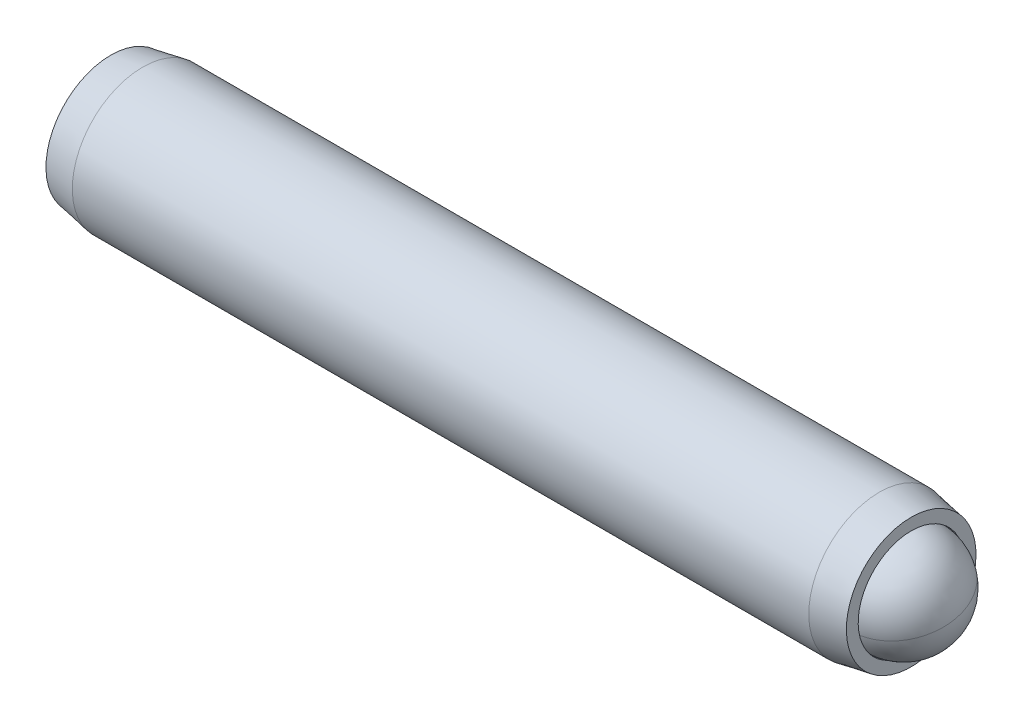
ISO-10303-21;
HEADER;
FILE_DESCRIPTION(('STEP AP214'),'2;1');
FILE_NAME('part.step','',(''),(''),'','','');
FILE_SCHEMA(('AUTOMOTIVE_DESIGN { 1 0 10303 214 1 1 1 1 }'));
ENDSEC;
DATA;
#1=APPLICATION_CONTEXT('core data for automotive mechanical design processes');
#2=APPLICATION_PROTOCOL_DEFINITION('international standard','automotive_design',2000,#1);
#3=PRODUCT_CONTEXT('',#1,'mechanical');
#4=PRODUCT('Part','Part','',(#3));
#5=PRODUCT_RELATED_PRODUCT_CATEGORY('part','',(#4));
#6=PRODUCT_DEFINITION_FORMATION('','',#4);
#7=PRODUCT_DEFINITION_CONTEXT('part definition',#1,'design');
#8=PRODUCT_DEFINITION('design','',#6,#7);
#9=PRODUCT_DEFINITION_SHAPE('','',#8);
#10=(LENGTH_UNIT() NAMED_UNIT(*) SI_UNIT(.MILLI.,.METRE.));
#11=(NAMED_UNIT(*) PLANE_ANGLE_UNIT() SI_UNIT($,.RADIAN.));
#12=(NAMED_UNIT(*) SI_UNIT($,.STERADIAN.) SOLID_ANGLE_UNIT());
#13=UNCERTAINTY_MEASURE_WITH_UNIT(LENGTH_MEASURE(1.E-05),#10,'distance_accuracy_value','');
#14=(GEOMETRIC_REPRESENTATION_CONTEXT(3) GLOBAL_UNCERTAINTY_ASSIGNED_CONTEXT((#13)) GLOBAL_UNIT_ASSIGNED_CONTEXT((#10,
#11,#12)) REPRESENTATION_CONTEXT('',''));
#15=CARTESIAN_POINT('',(0.,0.,0.));
#16=DIRECTION('',(0.,0.,1.));
#17=DIRECTION('',(1.,0.,0.));
#18=AXIS2_PLACEMENT_3D('',#15,#16,#17);
#19=CARTESIAN_POINT('',(14.9674040529809,2.74204998828509,-0.965131231055239));
#20=DIRECTION('',(0.,0.972214232741158,0.234092899626454));
#21=DIRECTION('',(0.,0.234092899626454,-0.972214232741158));
#22=AXIS2_PLACEMENT_3D('',#19,#20,#21);
#23=SPHERICAL_SURFACE('',#22,2.38125);
#24=CARTESIAN_POINT('',(14.9674040529809,2.74204998828509,-0.965131231055239));
#25=DIRECTION('',(1.,0.,0.));
#26=DIRECTION('',(0.,0.234092899626454,-0.972214232741158));
#27=AXIS2_PLACEMENT_3D('',#24,#25,#26);
#28=CIRCLE('',#27,2.38125);
#29=CARTESIAN_POINT('',(14.9674040529809,3.29948370552059,-3.28021637277012));
#30=VERTEX_POINT('',#29);
#31=CARTESIAN_POINT('',(14.9674040529809,2.1846162710496,1.34995391065964));
#32=VERTEX_POINT('',#31);
#33=EDGE_CURVE('P0_E33',#30,#32,#28,.T.);
#34=ORIENTED_EDGE('',*,*,#33,.T.);
#35=CARTESIAN_POINT('',(14.9674040529809,2.74204998828509,-0.965131231055239));
#36=DIRECTION('',(0.,0.972214232741158,0.234092899626454));
#37=DIRECTION('',(1.,0.,0.));
#38=AXIS2_PLACEMENT_3D('',#35,#36,#37);
#39=CIRCLE('',#38,2.38125);
#40=EDGE_CURVE('P0_E10',#32,#30,#39,.T.);
#41=ORIENTED_EDGE('',*,*,#40,.T.);
#42=EDGE_LOOP('',(#34,#41));
#43=FACE_BOUND('',#42,.T.);
#44=ADVANCED_FACE('P0_F16',(#43),#23,.T.);
#45=ORIENTED_EDGE('',*,*,#33,.F.);
#46=CARTESIAN_POINT('',(14.9674040529809,2.74204998828509,-0.965131231055239));
#47=DIRECTION('',(0.,0.972214232741158,0.234092899626454));
#48=DIRECTION('',(1.,0.,0.));
#49=AXIS2_PLACEMENT_3D('',#46,#47,#48);
#50=CIRCLE('',#49,2.38125);
#51=EDGE_CURVE('P0_E23',#30,#32,#50,.T.);
#52=ORIENTED_EDGE('',*,*,#51,.T.);
#53=EDGE_LOOP('',(#45,#52));
#54=FACE_BOUND('',#53,.T.);
#55=ADVANCED_FACE('P0_F40',(#54),#23,.T.);
#56=ORIENTED_EDGE('',*,*,#40,.F.);
#57=EDGE_CURVE('P0_E36',#32,#30,#28,.T.);
#58=ORIENTED_EDGE('',*,*,#57,.T.);
#59=EDGE_LOOP('',(#56,#58));
#60=FACE_BOUND('',#59,.T.);
#61=ADVANCED_FACE('P0_F38',(#60),#23,.T.);
#62=ORIENTED_EDGE('',*,*,#51,.F.);
#63=ORIENTED_EDGE('',*,*,#57,.F.);
#64=EDGE_LOOP('',(#62,#63));
#65=FACE_BOUND('',#64,.T.);
#66=ADVANCED_FACE('P0_F18',(#65),#23,.T.);
#67=CLOSED_SHELL('',(#44,#55,#61,#66));
#68=MANIFOLD_SOLID_BREP('P0_B1',#67);
#69=CARTESIAN_POINT('',(-20.7513459470191,2.74204998828509,-0.965131231055238));
#70=DIRECTION('',(-1.,0.,0.));
#71=DIRECTION('',(0.,-1.,0.));
#72=AXIS2_PLACEMENT_3D('',#69,#70,#71);
#73=PLANE('',#72);
#74=DIRECTION('',(0.,0.866025403784438,-0.5));
#75=VECTOR('',#74,1.);
#76=CARTESIAN_POINT('',(-20.7513459470191,2.61504998828509,-2.33078112403965));
#77=LINE('',#76,#75);
#78=CARTESIAN_POINT('',(-20.7513459470191,1.49586248828508,-1.68461791964099));
#79=VERTEX_POINT('',#78);
#80=CARTESIAN_POINT('',(-20.7513459470191,2.74204998828509,-2.40410460822674));
#81=VERTEX_POINT('',#80);
#82=EDGE_CURVE('P1_E164',#79,#81,#77,.T.);
#83=ORIENTED_EDGE('',*,*,#82,.T.);
#84=DIRECTION('',(0.,0.866025403784439,0.5));
#85=VECTOR('',#84,1.);
#86=CARTESIAN_POINT('',(-20.7513459470191,3.86123748828509,-1.75794140382807));
#87=LINE('',#86,#85);
#88=CARTESIAN_POINT('',(-20.7513459470191,3.98823748828509,-1.68461791964099));
#89=VERTEX_POINT('',#88);
#90=EDGE_CURVE('P1_E166',#81,#89,#87,.T.);
#91=ORIENTED_EDGE('',*,*,#90,.T.);
#92=DIRECTION('',(0.,0.,1.));
#93=VECTOR('',#92,1.);
#94=CARTESIAN_POINT('',(-20.7513459470191,3.98823748828509,-0.392291510843657));
#95=LINE('',#94,#93);
#96=CARTESIAN_POINT('',(-20.7513459470191,3.98823748828509,-0.24564454246949));
#97=VERTEX_POINT('',#96);
#98=EDGE_CURVE('P1_E156',#89,#97,#95,.T.);
#99=ORIENTED_EDGE('',*,*,#98,.T.);
#100=DIRECTION('',(0.,-0.866025403784438,0.5));
#101=VECTOR('',#100,1.);
#102=CARTESIAN_POINT('',(-20.7513459470191,2.86904998828509,0.400518661929177));
#103=LINE('',#102,#101);
#104=CARTESIAN_POINT('',(-20.7513459470191,2.74204998828509,0.47384214611626));
#105=VERTEX_POINT('',#104);
#106=EDGE_CURVE('P1_E158',#97,#105,#103,.T.);
#107=ORIENTED_EDGE('',*,*,#106,.T.);
#108=DIRECTION('',(0.,-0.866025403784439,-0.499999999999999));
#109=VECTOR('',#108,1.);
#110=CARTESIAN_POINT('',(-20.7513459470191,1.62286248828509,-0.172321058282405));
#111=LINE('',#110,#109);
#112=CARTESIAN_POINT('',(-20.7513459470191,1.49586248828508,-0.245644542469489));
#113=VERTEX_POINT('',#112);
#114=EDGE_CURVE('P1_E160',#105,#113,#111,.T.);
#115=ORIENTED_EDGE('',*,*,#114,.T.);
#116=DIRECTION('',(0.,0.,-1.));
#117=VECTOR('',#116,1.);
#118=CARTESIAN_POINT('',(-20.7513459470191,1.49586248828508,-1.53797095126682));
#119=LINE('',#118,#117);
#120=EDGE_CURVE('P1_E162',#113,#79,#119,.T.);
#121=ORIENTED_EDGE('',*,*,#120,.T.);
#122=EDGE_LOOP('',(#83,#91,#99,#107,#115,#121));
#123=FACE_BOUND('',#122,.T.);
#124=CARTESIAN_POINT('',(-20.7513459470191,2.74204998828509,-0.965131231055238));
#125=DIRECTION('',(1.,0.,0.));
#126=DIRECTION('',(0.,1.,0.));
#127=AXIS2_PLACEMENT_3D('',#124,#125,#126);
#128=CIRCLE('',#127,2.921);
#129=CARTESIAN_POINT('',(-20.7513459470191,5.66304998828509,-0.965131231055238));
#130=VERTEX_POINT('',#129);
#131=EDGE_CURVE('P1_E150',#130,#130,#128,.T.);
#132=ORIENTED_EDGE('',*,*,#131,.F.);
#133=EDGE_LOOP('',(#132));
#134=FACE_BOUND('',#133,.T.);
#135=ADVANCED_FACE('P1_F17',(#123,#134),#73,.T.);
#136=CARTESIAN_POINT('',(-19.3108403648362,2.74204998828509,-0.965131231055238));
#137=DIRECTION('',(1.,0.,0.));
#138=DIRECTION('',(0.,1.,0.));
#139=AXIS2_PLACEMENT_3D('',#136,#137,#138);
#140=CONICAL_SURFACE('',#139,3.175,0.174532925199433);
#141=ORIENTED_EDGE('',*,*,#131,.T.);
#142=EDGE_LOOP('',(#141));
#143=FACE_BOUND('',#142,.T.);
#144=CARTESIAN_POINT('',(-19.3108403648362,2.74204998828509,-0.965131231055238));
#145=DIRECTION('',(1.,0.,0.));
#146=DIRECTION('',(0.,1.,0.));
#147=AXIS2_PLACEMENT_3D('',#144,#145,#146);
#148=CIRCLE('',#147,3.175);
#149=CARTESIAN_POINT('',(-19.3108403648362,5.91704998828509,-0.965131231055238));
#150=VERTEX_POINT('',#149);
#151=EDGE_CURVE('P1_E147',#150,#150,#148,.T.);
#152=ORIENTED_EDGE('',*,*,#151,.F.);
#153=EDGE_LOOP('',(#152));
#154=FACE_BOUND('',#153,.T.);
#155=ADVANCED_FACE('P1_F225',(#143,#154),#140,.T.);
#156=CARTESIAN_POINT('',(11.59980800758,2.7420499882851,-0.965131231055238));
#157=DIRECTION('',(1.,0.,0.));
#158=DIRECTION('',(0.,1.,0.));
#159=AXIS2_PLACEMENT_3D('',#156,#157,#158);
#160=CYLINDRICAL_SURFACE('',#159,3.175);
#161=ORIENTED_EDGE('',*,*,#151,.T.);
#162=EDGE_LOOP('',(#161));
#163=FACE_BOUND('',#162,.T.);
#164=CARTESIAN_POINT('',(13.876148470798,2.7420499882851,-0.965131231055238));
#165=DIRECTION('',(1.,0.,0.));
#166=DIRECTION('',(0.,1.,0.));
#167=AXIS2_PLACEMENT_3D('',#164,#165,#166);
#168=CIRCLE('',#167,3.175);
#169=CARTESIAN_POINT('',(13.876148470798,5.91704998828509,-0.965131231055238));
#170=VERTEX_POINT('',#169);
#171=EDGE_CURVE('P1_E144',#170,#170,#168,.T.);
#172=ORIENTED_EDGE('',*,*,#171,.F.);
#173=EDGE_LOOP('',(#172));
#174=FACE_BOUND('',#173,.T.);
#175=ADVANCED_FACE('P1_F231',(#163,#174),#160,.T.);
#176=CARTESIAN_POINT('',(15.3166540529809,2.7420499882851,-0.965131231055238));
#177=DIRECTION('',(-1.,0.,0.));
#178=DIRECTION('',(0.,-1.,0.));
#179=AXIS2_PLACEMENT_3D('',#176,#177,#178);
#180=CONICAL_SURFACE('',#179,2.921,0.174532925199434);
#181=ORIENTED_EDGE('',*,*,#171,.T.);
#182=EDGE_LOOP('',(#181));
#183=FACE_BOUND('',#182,.T.);
#184=CARTESIAN_POINT('',(15.3166540529809,2.7420499882851,-0.965131231055238));
#185=DIRECTION('',(1.,0.,0.));
#186=DIRECTION('',(0.,1.,0.));
#187=AXIS2_PLACEMENT_3D('',#184,#185,#186);
#188=CIRCLE('',#187,2.921);
#189=CARTESIAN_POINT('',(15.3166540529809,5.66304998828509,-0.965131231055238));
#190=VERTEX_POINT('',#189);
#191=EDGE_CURVE('P1_E141',#190,#190,#188,.T.);
#192=ORIENTED_EDGE('',*,*,#191,.F.);
#193=EDGE_LOOP('',(#192));
#194=FACE_BOUND('',#193,.T.);
#195=ADVANCED_FACE('P1_F275',(#183,#194),#180,.T.);
#196=CARTESIAN_POINT('',(15.3166540529809,5.66304998828509,-0.965131231055238));
#197=DIRECTION('',(1.,0.,0.));
#198=DIRECTION('',(0.,1.,0.));
#199=AXIS2_PLACEMENT_3D('',#196,#197,#198);
#200=PLANE('',#199);
#201=ORIENTED_EDGE('',*,*,#191,.T.);
#202=EDGE_LOOP('',(#201));
#203=FACE_BOUND('',#202,.T.);
#204=CARTESIAN_POINT('',(15.3166540529809,2.7420499882851,-0.965131231055238));
#205=DIRECTION('',(1.,0.,0.));
#206=DIRECTION('',(0.,1.,0.));
#207=AXIS2_PLACEMENT_3D('',#204,#205,#206);
#208=CIRCLE('',#207,2.3876);
#209=CARTESIAN_POINT('',(15.3166540529809,5.1296499882851,-0.965131231055238));
#210=VERTEX_POINT('',#209);
#211=EDGE_CURVE('P1_E138',#210,#210,#208,.T.);
#212=ORIENTED_EDGE('',*,*,#211,.F.);
#213=EDGE_LOOP('',(#212));
#214=FACE_BOUND('',#213,.T.);
#215=ADVANCED_FACE('P1_F271',(#203,#214),#200,.T.);
#216=CARTESIAN_POINT('',(11.59980800758,2.7420499882851,-0.965131231055238));
#217=DIRECTION('',(1.,0.,0.));
#218=DIRECTION('',(0.,1.,0.));
#219=AXIS2_PLACEMENT_3D('',#216,#217,#218);
#220=CYLINDRICAL_SURFACE('',#219,2.3876);
#221=ORIENTED_EDGE('',*,*,#211,.T.);
#222=EDGE_LOOP('',(#221));
#223=FACE_BOUND('',#222,.T.);
#224=CARTESIAN_POINT('',(13.98740800758,2.7420499882851,-0.965131231055238));
#225=DIRECTION('',(1.,0.,0.));
#226=DIRECTION('',(0.,1.,0.));
#227=AXIS2_PLACEMENT_3D('',#224,#225,#226);
#228=CIRCLE('',#227,2.3876);
#229=CARTESIAN_POINT('',(13.98740800758,5.1296499882851,-0.965131231055238));
#230=VERTEX_POINT('',#229);
#231=EDGE_CURVE('P1_E126',#230,#230,#228,.T.);
#232=ORIENTED_EDGE('',*,*,#231,.F.);
#233=EDGE_LOOP('',(#232));
#234=FACE_BOUND('',#233,.T.);
#235=ADVANCED_FACE('P1_F267',(#223,#234),#220,.F.);
#236=CARTESIAN_POINT('',(11.59980800758,2.7420499882851,-0.965131231055238));
#237=DIRECTION('',(1.,0.,0.));
#238=DIRECTION('',(0.,1.,0.));
#239=AXIS2_PLACEMENT_3D('',#236,#237,#238);
#240=CONICAL_SURFACE('',#239,0.,0.78539816339745);
#241=ORIENTED_EDGE('',*,*,#231,.T.);
#242=EDGE_LOOP('',(#241));
#243=FACE_BOUND('',#242,.T.);
#244=CARTESIAN_POINT('',(11.59980800758,2.7420499882851,-0.965131231055238));
#245=VERTEX_POINT('',#244);
#246=VERTEX_LOOP('',#245);
#247=FACE_BOUND('',#246,.T.);
#248=ADVANCED_FACE('P1_F221',(#243,#247),#240,.F.);
#249=CARTESIAN_POINT('',(-17.7033459470191,2.74204998828509,0.180548209367926));
#250=DIRECTION('',(0.,0.5,0.866025403784438));
#251=DIRECTION('',(0.,-0.866025403784438,0.5));
#252=AXIS2_PLACEMENT_3D('',#249,#250,#251);
#253=PLANE('',#252);
#254=DIRECTION('',(-1.,0.,0.));
#255=VECTOR('',#254,1.);
#256=CARTESIAN_POINT('',(-17.7033459470191,2.74204998828509,0.180548209367926));
#257=LINE('',#256,#255);
#258=CARTESIAN_POINT('',(-17.7033459470191,2.74204998828509,0.180548209367926));
#259=VERTEX_POINT('',#258);
#260=CARTESIAN_POINT('',(-20.4973459470191,2.74204998828509,0.180548209367926));
#261=VERTEX_POINT('',#260);
#262=EDGE_CURVE('P1_E124',#259,#261,#257,.T.);
#263=ORIENTED_EDGE('',*,*,#262,.T.);
#264=DIRECTION('',(0.,0.866025403784438,-0.5));
#265=VECTOR('',#264,1.);
#266=CARTESIAN_POINT('',(-20.4973459470191,3.73423748828509,-0.392291510843657));
#267=LINE('',#266,#265);
#268=CARTESIAN_POINT('',(-20.4973459470191,3.73423748828509,-0.392291510843657));
#269=VERTEX_POINT('',#268);
#270=EDGE_CURVE('P1_E26',#261,#269,#267,.T.);
#271=ORIENTED_EDGE('',*,*,#270,.T.);
#272=DIRECTION('',(-1.,0.,0.));
#273=VECTOR('',#272,1.);
#274=CARTESIAN_POINT('',(-17.7033459470191,3.73423748828509,-0.392291510843657));
#275=LINE('',#274,#273);
#276=CARTESIAN_POINT('',(-17.7033459470191,3.73423748828509,-0.392291510843657));
#277=VERTEX_POINT('',#276);
#278=EDGE_CURVE('P1_E90',#277,#269,#275,.T.);
#279=ORIENTED_EDGE('',*,*,#278,.F.);
#280=DIRECTION('',(0.,0.866025403784438,-0.5));
#281=VECTOR('',#280,1.);
#282=CARTESIAN_POINT('',(-17.7033459470191,2.74204998828509,0.180548209367926));
#283=LINE('',#282,#281);
#284=EDGE_CURVE('P1_E94',#259,#277,#283,.T.);
#285=ORIENTED_EDGE('',*,*,#284,.F.);
#286=EDGE_LOOP('',(#263,#271,#279,#285));
#287=FACE_BOUND('',#286,.T.);
#288=ADVANCED_FACE('P1_F92',(#287),#253,.F.);
#289=CARTESIAN_POINT('',(-17.7033459470191,1.74986248828509,-0.392291510843656));
#290=DIRECTION('',(0.,-0.499999999999999,0.866025403784439));
#291=DIRECTION('',(0.,-0.866025403784439,-0.499999999999999));
#292=AXIS2_PLACEMENT_3D('',#289,#290,#291);
#293=PLANE('',#292);
#294=DIRECTION('',(-1.,0.,0.));
#295=VECTOR('',#294,1.);
#296=CARTESIAN_POINT('',(-17.7033459470191,1.74986248828509,-0.392291510843656));
#297=LINE('',#296,#295);
#298=CARTESIAN_POINT('',(-17.7033459470191,1.74986248828509,-0.392291510843656));
#299=VERTEX_POINT('',#298);
#300=CARTESIAN_POINT('',(-20.4973459470191,1.74986248828509,-0.392291510843656));
#301=VERTEX_POINT('',#300);
#302=EDGE_CURVE('P1_E127',#299,#301,#297,.T.);
#303=ORIENTED_EDGE('',*,*,#302,.T.);
#304=DIRECTION('',(0.,0.866025403784439,0.499999999999999));
#305=VECTOR('',#304,1.);
#306=CARTESIAN_POINT('',(-20.4973459470191,2.74204998828509,0.180548209367926));
#307=LINE('',#306,#305);
#308=EDGE_CURVE('P1_E41',#301,#261,#307,.T.);
#309=ORIENTED_EDGE('',*,*,#308,.T.);
#310=ORIENTED_EDGE('',*,*,#262,.F.);
#311=DIRECTION('',(0.,0.866025403784439,0.499999999999999));
#312=VECTOR('',#311,1.);
#313=CARTESIAN_POINT('',(-17.7033459470191,1.74986248828509,-0.392291510843656));
#314=LINE('',#313,#312);
#315=EDGE_CURVE('P1_E99',#299,#259,#314,.T.);
#316=ORIENTED_EDGE('',*,*,#315,.F.);
#317=EDGE_LOOP('',(#303,#309,#310,#316));
#318=FACE_BOUND('',#317,.T.);
#319=ADVANCED_FACE('P1_F212',(#318),#293,.F.);
#320=CARTESIAN_POINT('',(-17.7033459470191,1.74986248828509,-1.53797095126682));
#321=DIRECTION('',(0.,-1.,0.));
#322=DIRECTION('',(0.,0.,-1.));
#323=AXIS2_PLACEMENT_3D('',#320,#321,#322);
#324=PLANE('',#323);
#325=DIRECTION('',(-1.,0.,0.));
#326=VECTOR('',#325,1.);
#327=CARTESIAN_POINT('',(-17.7033459470191,1.74986248828509,-1.53797095126682));
#328=LINE('',#327,#326);
#329=CARTESIAN_POINT('',(-17.7033459470191,1.74986248828509,-1.53797095126682));
#330=VERTEX_POINT('',#329);
#331=CARTESIAN_POINT('',(-20.4973459470191,1.74986248828509,-1.53797095126682));
#332=VERTEX_POINT('',#331);
#333=EDGE_CURVE('P1_E129',#330,#332,#328,.T.);
#334=ORIENTED_EDGE('',*,*,#333,.T.);
#335=DIRECTION('',(0.,0.,1.));
#336=VECTOR('',#335,1.);
#337=CARTESIAN_POINT('',(-20.4973459470191,1.74986248828509,-0.392291510843656));
#338=LINE('',#337,#336);
#339=EDGE_CURVE('P1_E171',#332,#301,#338,.T.);
#340=ORIENTED_EDGE('',*,*,#339,.T.);
#341=ORIENTED_EDGE('',*,*,#302,.F.);
#342=DIRECTION('',(0.,0.,1.));
#343=VECTOR('',#342,1.);
#344=CARTESIAN_POINT('',(-17.7033459470191,1.74986248828509,-1.53797095126682));
#345=LINE('',#344,#343);
#346=EDGE_CURVE('P1_E121',#330,#299,#345,.T.);
#347=ORIENTED_EDGE('',*,*,#346,.F.);
#348=EDGE_LOOP('',(#334,#340,#341,#347));
#349=FACE_BOUND('',#348,.T.);
#350=ADVANCED_FACE('P1_F211',(#349),#324,.F.);
#351=CARTESIAN_POINT('',(-17.7033459470191,2.74204998828509,-2.1108106714784));
#352=DIRECTION('',(0.,-0.5,-0.866025403784438));
#353=DIRECTION('',(0.,0.866025403784438,-0.5));
#354=AXIS2_PLACEMENT_3D('',#351,#352,#353);
#355=PLANE('',#354);
#356=DIRECTION('',(-1.,0.,0.));
#357=VECTOR('',#356,1.);
#358=CARTESIAN_POINT('',(-17.7033459470191,2.74204998828509,-2.1108106714784));
#359=LINE('',#358,#357);
#360=CARTESIAN_POINT('',(-17.7033459470191,2.74204998828509,-2.1108106714784));
#361=VERTEX_POINT('',#360);
#362=CARTESIAN_POINT('',(-20.4973459470191,2.74204998828509,-2.1108106714784));
#363=VERTEX_POINT('',#362);
#364=EDGE_CURVE('P1_E132',#361,#363,#359,.T.);
#365=ORIENTED_EDGE('',*,*,#364,.T.);
#366=DIRECTION('',(0.,-0.866025403784438,0.5));
#367=VECTOR('',#366,1.);
#368=CARTESIAN_POINT('',(-20.4973459470191,1.74986248828509,-1.53797095126682));
#369=LINE('',#368,#367);
#370=EDGE_CURVE('P1_E169',#363,#332,#369,.T.);
#371=ORIENTED_EDGE('',*,*,#370,.T.);
#372=ORIENTED_EDGE('',*,*,#333,.F.);
#373=DIRECTION('',(0.,-0.866025403784438,0.5));
#374=VECTOR('',#373,1.);
#375=CARTESIAN_POINT('',(-17.7033459470191,2.74204998828509,-2.1108106714784));
#376=LINE('',#375,#374);
#377=EDGE_CURVE('P1_E118',#361,#330,#376,.T.);
#378=ORIENTED_EDGE('',*,*,#377,.F.);
#379=EDGE_LOOP('',(#365,#371,#372,#378));
#380=FACE_BOUND('',#379,.T.);
#381=ADVANCED_FACE('P1_F208',(#380),#355,.F.);
#382=CARTESIAN_POINT('',(-17.7033459470191,3.73423748828509,-1.53797095126682));
#383=DIRECTION('',(0.,0.5,-0.866025403784439));
#384=DIRECTION('',(0.,0.866025403784439,0.5));
#385=AXIS2_PLACEMENT_3D('',#382,#383,#384);
#386=PLANE('',#385);
#387=DIRECTION('',(-1.,0.,0.));
#388=VECTOR('',#387,1.);
#389=CARTESIAN_POINT('',(-17.7033459470191,3.73423748828509,-1.53797095126682));
#390=LINE('',#389,#388);
#391=CARTESIAN_POINT('',(-17.7033459470191,3.73423748828509,-1.53797095126682));
#392=VERTEX_POINT('',#391);
#393=CARTESIAN_POINT('',(-20.4973459470191,3.73423748828509,-1.53797095126682));
#394=VERTEX_POINT('',#393);
#395=EDGE_CURVE('P1_E98',#392,#394,#390,.T.);
#396=ORIENTED_EDGE('',*,*,#395,.T.);
#397=DIRECTION('',(0.,-0.866025403784439,-0.5));
#398=VECTOR('',#397,1.);
#399=CARTESIAN_POINT('',(-20.4973459470191,2.74204998828509,-2.1108106714784));
#400=LINE('',#399,#398);
#401=EDGE_CURVE('P1_E153',#394,#363,#400,.T.);
#402=ORIENTED_EDGE('',*,*,#401,.T.);
#403=ORIENTED_EDGE('',*,*,#364,.F.);
#404=DIRECTION('',(0.,-0.866025403784439,-0.5));
#405=VECTOR('',#404,1.);
#406=CARTESIAN_POINT('',(-17.7033459470191,3.73423748828509,-1.53797095126682));
#407=LINE('',#406,#405);
#408=EDGE_CURVE('P1_E108',#392,#361,#407,.T.);
#409=ORIENTED_EDGE('',*,*,#408,.F.);
#410=EDGE_LOOP('',(#396,#402,#403,#409));
#411=FACE_BOUND('',#410,.T.);
#412=ADVANCED_FACE('P1_F204',(#411),#386,.F.);
#413=CARTESIAN_POINT('',(-17.7033459470191,3.73423748828509,-0.392291510843657));
#414=DIRECTION('',(0.,1.,0.));
#415=DIRECTION('',(-1.,0.,0.));
#416=AXIS2_PLACEMENT_3D('',#413,#414,#415);
#417=PLANE('',#416);
#418=ORIENTED_EDGE('',*,*,#278,.T.);
#419=DIRECTION('',(0.,0.,-1.));
#420=VECTOR('',#419,1.);
#421=CARTESIAN_POINT('',(-20.4973459470191,3.73423748828509,-1.53797095126682));
#422=LINE('',#421,#420);
#423=EDGE_CURVE('P1_E11',#269,#394,#422,.T.);
#424=ORIENTED_EDGE('',*,*,#423,.T.);
#425=ORIENTED_EDGE('',*,*,#395,.F.);
#426=DIRECTION('',(0.,0.,-1.));
#427=VECTOR('',#426,1.);
#428=CARTESIAN_POINT('',(-17.7033459470191,3.73423748828509,-0.392291510843657));
#429=LINE('',#428,#427);
#430=EDGE_CURVE('P1_E102',#277,#392,#429,.T.);
#431=ORIENTED_EDGE('',*,*,#430,.F.);
#432=EDGE_LOOP('',(#418,#424,#425,#431));
#433=FACE_BOUND('',#432,.T.);
#434=ADVANCED_FACE('P1_F103',(#433),#417,.F.);
#435=CARTESIAN_POINT('',(-17.7033459470191,4.72642498828509,-0.96513123105524));
#436=DIRECTION('',(-1.,0.,0.));
#437=DIRECTION('',(0.,0.,1.));
#438=AXIS2_PLACEMENT_3D('',#435,#436,#437);
#439=PLANE('',#438);
#440=ORIENTED_EDGE('',*,*,#284,.T.);
#441=ORIENTED_EDGE('',*,*,#430,.T.);
#442=ORIENTED_EDGE('',*,*,#408,.T.);
#443=ORIENTED_EDGE('',*,*,#377,.T.);
#444=ORIENTED_EDGE('',*,*,#346,.T.);
#445=ORIENTED_EDGE('',*,*,#315,.T.);
#446=EDGE_LOOP('',(#440,#441,#442,#443,#444,#445));
#447=FACE_BOUND('',#446,.T.);
#448=ADVANCED_FACE('P1_F110',(#447),#439,.T.);
#449=CARTESIAN_POINT('',(-20.4973459470191,1.74986248828509,-0.392291510843656));
#450=DIRECTION('',(-0.707106781186552,0.353553390593271,-0.612372435695791));
#451=DIRECTION('',(-0.654653670707972,0.,0.755928946018459));
#452=AXIS2_PLACEMENT_3D('',#449,#450,#451);
#453=PLANE('',#452);
#454=DIRECTION('',(-0.654653670707972,-0.654653670707981,0.377964473009229));
#455=VECTOR('',#454,1.);
#456=CARTESIAN_POINT('',(-20.213863804162,2.03334463114223,-0.555960002332681));
#457=LINE('',#456,#455);
#458=EDGE_CURVE('P1_E115',#113,#301,#457,.F.);
#459=ORIENTED_EDGE('',*,*,#458,.F.);
#460=ORIENTED_EDGE('',*,*,#114,.F.);
#461=DIRECTION('',(-0.654653670707972,0.,0.755928946018459));
#462=VECTOR('',#461,1.);
#463=CARTESIAN_POINT('',(-20.213863804162,2.74204998828509,-0.146788773610126));
#464=LINE('',#463,#462);
#465=EDGE_CURVE('P1_E21',#261,#105,#464,.T.);
#466=ORIENTED_EDGE('',*,*,#465,.F.);
#467=ORIENTED_EDGE('',*,*,#308,.F.);
#468=EDGE_LOOP('',(#459,#460,#466,#467));
#469=FACE_BOUND('',#468,.T.);
#470=ADVANCED_FACE('P1_F19',(#469),#453,.T.);
#471=CARTESIAN_POINT('',(-20.4973459470191,2.74204998828509,0.180548209367926));
#472=DIRECTION('',(-0.707106781186552,-0.353553390593272,-0.61237243569579));
#473=DIRECTION('',(-0.654653670707972,0.,0.755928946018459));
#474=AXIS2_PLACEMENT_3D('',#471,#472,#473);
#475=PLANE('',#474);
#476=ORIENTED_EDGE('',*,*,#465,.T.);
#477=ORIENTED_EDGE('',*,*,#106,.F.);
#478=DIRECTION('',(-0.654653670707972,0.654653670707981,0.377964473009229));
#479=VECTOR('',#478,1.);
#480=CARTESIAN_POINT('',(-20.213863804162,3.45075534542794,-0.555960002332682));
#481=LINE('',#480,#479);
#482=EDGE_CURVE('P1_E182',#269,#97,#481,.T.);
#483=ORIENTED_EDGE('',*,*,#482,.F.);
#484=ORIENTED_EDGE('',*,*,#270,.F.);
#485=EDGE_LOOP('',(#476,#477,#483,#484));
#486=FACE_BOUND('',#485,.T.);
#487=ADVANCED_FACE('P1_F196',(#486),#475,.T.);
#488=CARTESIAN_POINT('',(-20.4973459470191,1.74986248828509,-1.53797095126682));
#489=DIRECTION('',(-0.707106781186552,0.707106781186543,0.));
#490=DIRECTION('',(-0.707106781186543,-0.707106781186552,0.));
#491=AXIS2_PLACEMENT_3D('',#488,#489,#490);
#492=PLANE('',#491);
#493=ORIENTED_EDGE('',*,*,#458,.T.);
#494=ORIENTED_EDGE('',*,*,#339,.F.);
#495=DIRECTION('',(-0.654653670707972,-0.654653670707982,-0.377964473009228));
#496=VECTOR('',#495,1.);
#497=CARTESIAN_POINT('',(-20.213863804162,2.03334463114223,-1.3743024597778));
#498=LINE('',#497,#496);
#499=EDGE_CURVE('P1_E179',#79,#332,#498,.F.);
#500=ORIENTED_EDGE('',*,*,#499,.F.);
#501=ORIENTED_EDGE('',*,*,#120,.F.);
#502=EDGE_LOOP('',(#493,#494,#500,#501));
#503=FACE_BOUND('',#502,.T.);
#504=ADVANCED_FACE('P1_F189',(#503),#492,.T.);
#505=CARTESIAN_POINT('',(-20.4973459470191,3.73423748828509,-0.392291510843657));
#506=DIRECTION('',(-0.707106781186552,-0.707106781186543,0.));
#507=DIRECTION('',(0.707106781186543,-0.707106781186552,0.));
#508=AXIS2_PLACEMENT_3D('',#505,#506,#507);
#509=PLANE('',#508);
#510=ORIENTED_EDGE('',*,*,#482,.T.);
#511=ORIENTED_EDGE('',*,*,#98,.F.);
#512=DIRECTION('',(0.654653670707972,-0.654653670707981,0.377964473009229));
#513=VECTOR('',#512,1.);
#514=CARTESIAN_POINT('',(-20.4973459470191,3.73423748828509,-1.53797095126682));
#515=LINE('',#514,#513);
#516=EDGE_CURVE('P1_E177',#394,#89,#515,.F.);
#517=ORIENTED_EDGE('',*,*,#516,.F.);
#518=ORIENTED_EDGE('',*,*,#423,.F.);
#519=EDGE_LOOP('',(#510,#511,#517,#518));
#520=FACE_BOUND('',#519,.T.);
#521=ADVANCED_FACE('P1_F201',(#520),#509,.T.);
#522=CARTESIAN_POINT('',(-20.4973459470191,2.74204998828509,-2.1108106714784));
#523=DIRECTION('',(-0.707106781186552,0.353553390593272,0.612372435695791));
#524=DIRECTION('',(0.654653670707973,0.,0.755928946018459));
#525=AXIS2_PLACEMENT_3D('',#522,#523,#524);
#526=PLANE('',#525);
#527=ORIENTED_EDGE('',*,*,#499,.T.);
#528=ORIENTED_EDGE('',*,*,#370,.F.);
#529=DIRECTION('',(-0.654653670707973,0.,-0.755928946018459));
#530=VECTOR('',#529,1.);
#531=CARTESIAN_POINT('',(-20.213863804162,2.74204998828509,-1.78347368850035));
#532=LINE('',#531,#530);
#533=EDGE_CURVE('P1_E175',#81,#363,#532,.F.);
#534=ORIENTED_EDGE('',*,*,#533,.F.);
#535=ORIENTED_EDGE('',*,*,#82,.F.);
#536=EDGE_LOOP('',(#527,#528,#534,#535));
#537=FACE_BOUND('',#536,.T.);
#538=ADVANCED_FACE('P1_F240',(#537),#526,.T.);
#539=CARTESIAN_POINT('',(-20.4973459470191,3.73423748828509,-1.53797095126682));
#540=DIRECTION('',(-0.707106781186552,-0.353553390593271,0.612372435695791));
#541=DIRECTION('',(0.654653670707973,0.,0.755928946018458));
#542=AXIS2_PLACEMENT_3D('',#539,#540,#541);
#543=PLANE('',#542);
#544=ORIENTED_EDGE('',*,*,#516,.T.);
#545=ORIENTED_EDGE('',*,*,#90,.F.);
#546=ORIENTED_EDGE('',*,*,#533,.T.);
#547=ORIENTED_EDGE('',*,*,#401,.F.);
#548=EDGE_LOOP('',(#544,#545,#546,#547));
#549=FACE_BOUND('',#548,.T.);
#550=ADVANCED_FACE('P1_F237',(#549),#543,.T.);
#551=CLOSED_SHELL('',(#135,#155,#175,#195,#215,#235,#248,#288,#319,#350,#381,#412,#434,#448,
#470,#487,#504,#521,#538,#550));
#552=MANIFOLD_SOLID_BREP('P1_B1',#551);
#553=ADVANCED_BREP_SHAPE_REPRESENTATION('',(#18,#68,#552),#14);
#554=SHAPE_DEFINITION_REPRESENTATION(#9,#553);
ENDSEC;
END-ISO-10303-21;
